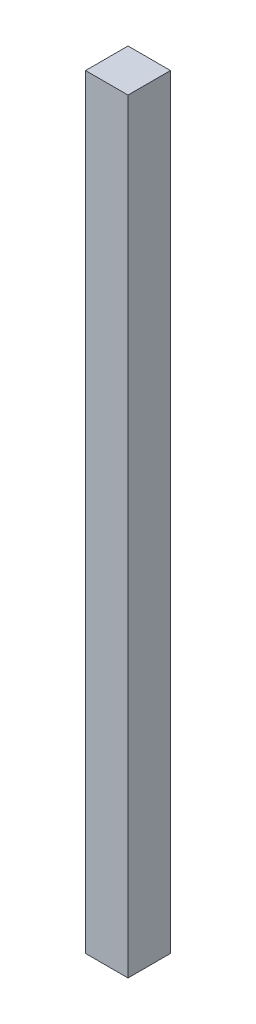
ISO-10303-21;
HEADER;
FILE_DESCRIPTION(('STEP AP214'),'2;1');
FILE_NAME('part.step','',(''),(''),'','','');
FILE_SCHEMA(('AUTOMOTIVE_DESIGN { 1 0 10303 214 1 1 1 1 }'));
ENDSEC;
DATA;
#1=APPLICATION_CONTEXT('core data for automotive mechanical design processes');
#2=APPLICATION_PROTOCOL_DEFINITION('international standard','automotive_design',2000,#1);
#3=PRODUCT_CONTEXT('',#1,'mechanical');
#4=PRODUCT('Part','Part','',(#3));
#5=PRODUCT_RELATED_PRODUCT_CATEGORY('part','',(#4));
#6=PRODUCT_DEFINITION_FORMATION('','',#4);
#7=PRODUCT_DEFINITION_CONTEXT('part definition',#1,'design');
#8=PRODUCT_DEFINITION('design','',#6,#7);
#9=PRODUCT_DEFINITION_SHAPE('','',#8);
#10=(LENGTH_UNIT() NAMED_UNIT(*) SI_UNIT(.MILLI.,.METRE.));
#11=(NAMED_UNIT(*) PLANE_ANGLE_UNIT() SI_UNIT($,.RADIAN.));
#12=(NAMED_UNIT(*) SI_UNIT($,.STERADIAN.) SOLID_ANGLE_UNIT());
#13=UNCERTAINTY_MEASURE_WITH_UNIT(LENGTH_MEASURE(1.E-05),#10,'distance_accuracy_value','');
#14=(GEOMETRIC_REPRESENTATION_CONTEXT(3) GLOBAL_UNCERTAINTY_ASSIGNED_CONTEXT((#13)) GLOBAL_UNIT_ASSIGNED_CONTEXT((#10,
#11,#12)) REPRESENTATION_CONTEXT('',''));
#15=CARTESIAN_POINT('',(0.,0.,0.));
#16=DIRECTION('',(0.,0.,1.));
#17=DIRECTION('',(1.,0.,0.));
#18=AXIS2_PLACEMENT_3D('',#15,#16,#17);
#19=CARTESIAN_POINT('',(-50.,900.,-29.0760869565217));
#20=DIRECTION('',(1.,0.,0.));
#21=DIRECTION('',(0.,0.,-1.));
#22=AXIS2_PLACEMENT_3D('',#19,#20,#21);
#23=PLANE('',#22);
#24=DIRECTION('',(0.,0.,1.));
#25=VECTOR('',#24,1.);
#26=CARTESIAN_POINT('',(-50.,0.,-29.0760869565217));
#27=LINE('',#26,#25);
#28=CARTESIAN_POINT('',(-50.,0.,-29.0760869565217));
#29=VERTEX_POINT('',#28);
#30=CARTESIAN_POINT('',(-50.,0.,20.9239130434783));
#31=VERTEX_POINT('',#30);
#32=EDGE_CURVE('E107',#29,#31,#27,.T.);
#33=ORIENTED_EDGE('',*,*,#32,.T.);
#34=DIRECTION('',(0.,-1.,0.));
#35=VECTOR('',#34,1.);
#36=CARTESIAN_POINT('',(-50.,900.,20.9239130434783));
#37=LINE('',#36,#35);
#38=CARTESIAN_POINT('',(-50.,900.,20.9239130434783));
#39=VERTEX_POINT('',#38);
#40=EDGE_CURVE('E11',#39,#31,#37,.T.);
#41=ORIENTED_EDGE('',*,*,#40,.F.);
#42=DIRECTION('',(0.,0.,1.));
#43=VECTOR('',#42,1.);
#44=CARTESIAN_POINT('',(-50.,900.,-29.0760869565217));
#45=LINE('',#44,#43);
#46=CARTESIAN_POINT('',(-50.,900.,-29.0760869565217));
#47=VERTEX_POINT('',#46);
#48=EDGE_CURVE('E89',#47,#39,#45,.T.);
#49=ORIENTED_EDGE('',*,*,#48,.F.);
#50=DIRECTION('',(0.,-1.,0.));
#51=VECTOR('',#50,1.);
#52=CARTESIAN_POINT('',(-50.,900.,-29.0760869565217));
#53=LINE('',#52,#51);
#54=EDGE_CURVE('E56',#47,#29,#53,.T.);
#55=ORIENTED_EDGE('',*,*,#54,.T.);
#56=EDGE_LOOP('',(#33,#41,#49,#55));
#57=FACE_BOUND('',#56,.T.);
#58=ADVANCED_FACE('F39',(#57),#23,.F.);
#59=CARTESIAN_POINT('',(-50.,900.,20.9239130434783));
#60=DIRECTION('',(0.,0.,-1.));
#61=DIRECTION('',(-1.,0.,0.));
#62=AXIS2_PLACEMENT_3D('',#59,#60,#61);
#63=PLANE('',#62);
#64=DIRECTION('',(1.,0.,0.));
#65=VECTOR('',#64,1.);
#66=CARTESIAN_POINT('',(-50.,0.,20.9239130434783));
#67=LINE('',#66,#65);
#68=CARTESIAN_POINT('',(0.,0.,20.9239130434783));
#69=VERTEX_POINT('',#68);
#70=EDGE_CURVE('E95',#31,#69,#67,.T.);
#71=ORIENTED_EDGE('',*,*,#70,.T.);
#72=DIRECTION('',(0.,-1.,0.));
#73=VECTOR('',#72,1.);
#74=CARTESIAN_POINT('',(0.,900.,20.9239130434783));
#75=LINE('',#74,#73);
#76=CARTESIAN_POINT('',(0.,900.,20.9239130434783));
#77=VERTEX_POINT('',#76);
#78=EDGE_CURVE('E48',#77,#69,#75,.T.);
#79=ORIENTED_EDGE('',*,*,#78,.F.);
#80=DIRECTION('',(1.,0.,0.));
#81=VECTOR('',#80,1.);
#82=CARTESIAN_POINT('',(-50.,900.,20.9239130434783));
#83=LINE('',#82,#81);
#84=EDGE_CURVE('E81',#39,#77,#83,.T.);
#85=ORIENTED_EDGE('',*,*,#84,.F.);
#86=ORIENTED_EDGE('',*,*,#40,.T.);
#87=EDGE_LOOP('',(#71,#79,#85,#86));
#88=FACE_BOUND('',#87,.T.);
#89=ADVANCED_FACE('F94',(#88),#63,.F.);
#90=CARTESIAN_POINT('',(0.,900.,-29.0760869565217));
#91=DIRECTION('',(1.,0.,0.));
#92=DIRECTION('',(0.,0.,-1.));
#93=AXIS2_PLACEMENT_3D('',#90,#91,#92);
#94=PLANE('',#93);
#95=DIRECTION('',(0.,0.,1.));
#96=VECTOR('',#95,1.);
#97=CARTESIAN_POINT('',(0.,0.,-29.0760869565217));
#98=LINE('',#97,#96);
#99=CARTESIAN_POINT('',(0.,0.,-29.0760869565217));
#100=VERTEX_POINT('',#99);
#101=EDGE_CURVE('E112',#100,#69,#98,.T.);
#102=ORIENTED_EDGE('',*,*,#101,.F.);
#103=DIRECTION('',(0.,-1.,0.));
#104=VECTOR('',#103,1.);
#105=CARTESIAN_POINT('',(0.,900.,-29.0760869565217));
#106=LINE('',#105,#104);
#107=CARTESIAN_POINT('',(0.,900.,-29.0760869565217));
#108=VERTEX_POINT('',#107);
#109=EDGE_CURVE('E70',#108,#100,#106,.T.);
#110=ORIENTED_EDGE('',*,*,#109,.F.);
#111=DIRECTION('',(0.,0.,1.));
#112=VECTOR('',#111,1.);
#113=CARTESIAN_POINT('',(0.,900.,-29.0760869565217));
#114=LINE('',#113,#112);
#115=EDGE_CURVE('E88',#108,#77,#114,.T.);
#116=ORIENTED_EDGE('',*,*,#115,.T.);
#117=ORIENTED_EDGE('',*,*,#78,.T.);
#118=EDGE_LOOP('',(#102,#110,#116,#117));
#119=FACE_BOUND('',#118,.T.);
#120=ADVANCED_FACE('F99',(#119),#94,.T.);
#121=CARTESIAN_POINT('',(-50.,900.,-29.0760869565217));
#122=DIRECTION('',(0.,0.,-1.));
#123=DIRECTION('',(-1.,0.,0.));
#124=AXIS2_PLACEMENT_3D('',#121,#122,#123);
#125=PLANE('',#124);
#126=DIRECTION('',(1.,0.,0.));
#127=VECTOR('',#126,1.);
#128=CARTESIAN_POINT('',(-50.,0.,-29.0760869565217));
#129=LINE('',#128,#127);
#130=EDGE_CURVE('E115',#29,#100,#129,.T.);
#131=ORIENTED_EDGE('',*,*,#130,.F.);
#132=ORIENTED_EDGE('',*,*,#54,.F.);
#133=DIRECTION('',(1.,0.,0.));
#134=VECTOR('',#133,1.);
#135=CARTESIAN_POINT('',(-50.,900.,-29.0760869565217));
#136=LINE('',#135,#134);
#137=EDGE_CURVE('E101',#47,#108,#136,.T.);
#138=ORIENTED_EDGE('',*,*,#137,.T.);
#139=ORIENTED_EDGE('',*,*,#109,.T.);
#140=EDGE_LOOP('',(#131,#132,#138,#139));
#141=FACE_BOUND('',#140,.T.);
#142=ADVANCED_FACE('F125',(#141),#125,.T.);
#143=CARTESIAN_POINT('',(0.,900.,0.));
#144=DIRECTION('',(0.,1.,0.));
#145=DIRECTION('',(0.,0.,1.));
#146=AXIS2_PLACEMENT_3D('',#143,#144,#145);
#147=PLANE('',#146);
#148=ORIENTED_EDGE('',*,*,#48,.T.);
#149=ORIENTED_EDGE('',*,*,#84,.T.);
#150=ORIENTED_EDGE('',*,*,#115,.F.);
#151=ORIENTED_EDGE('',*,*,#137,.F.);
#152=EDGE_LOOP('',(#148,#149,#150,#151));
#153=FACE_BOUND('',#152,.T.);
#154=ADVANCED_FACE('F85',(#153),#147,.T.);
#155=CARTESIAN_POINT('',(0.,0.,0.));
#156=DIRECTION('',(0.,1.,0.));
#157=DIRECTION('',(0.,0.,1.));
#158=AXIS2_PLACEMENT_3D('',#155,#156,#157);
#159=PLANE('',#158);
#160=ORIENTED_EDGE('',*,*,#32,.F.);
#161=ORIENTED_EDGE('',*,*,#130,.T.);
#162=ORIENTED_EDGE('',*,*,#101,.T.);
#163=ORIENTED_EDGE('',*,*,#70,.F.);
#164=EDGE_LOOP('',(#160,#161,#162,#163));
#165=FACE_BOUND('',#164,.T.);
#166=ADVANCED_FACE('F124',(#165),#159,.F.);
#167=CLOSED_SHELL('',(#58,#89,#120,#142,#154,#166));
#168=MANIFOLD_SOLID_BREP('B2',#167);
#169=ADVANCED_BREP_SHAPE_REPRESENTATION('',(#18,#168),#14);
#170=SHAPE_DEFINITION_REPRESENTATION(#9,#169);
ENDSEC;
END-ISO-10303-21;
